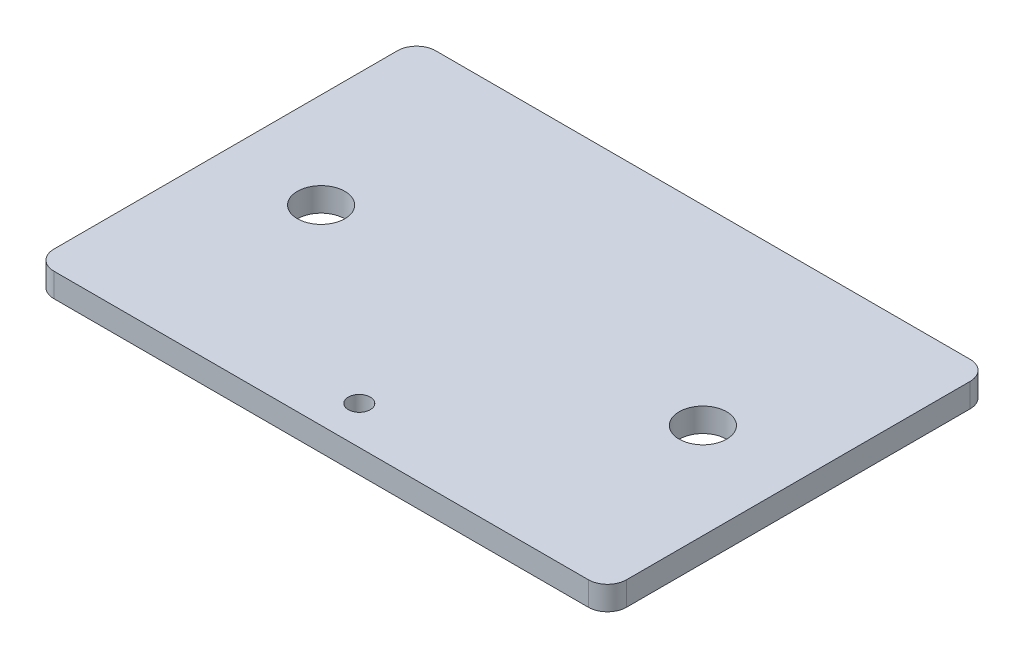
ISO-10303-21;
HEADER;
FILE_DESCRIPTION(('STEP AP214'),'2;1');
FILE_NAME('part.step','',(''),(''),'','','');
FILE_SCHEMA(('AUTOMOTIVE_DESIGN { 1 0 10303 214 1 1 1 1 }'));
ENDSEC;
DATA;
#1=APPLICATION_CONTEXT('core data for automotive mechanical design processes');
#2=APPLICATION_PROTOCOL_DEFINITION('international standard','automotive_design',2000,#1);
#3=PRODUCT_CONTEXT('',#1,'mechanical');
#4=PRODUCT('Part','Part','',(#3));
#5=PRODUCT_RELATED_PRODUCT_CATEGORY('part','',(#4));
#6=PRODUCT_DEFINITION_FORMATION('','',#4);
#7=PRODUCT_DEFINITION_CONTEXT('part definition',#1,'design');
#8=PRODUCT_DEFINITION('design','',#6,#7);
#9=PRODUCT_DEFINITION_SHAPE('','',#8);
#10=(LENGTH_UNIT() NAMED_UNIT(*) SI_UNIT(.MILLI.,.METRE.));
#11=(NAMED_UNIT(*) PLANE_ANGLE_UNIT() SI_UNIT($,.RADIAN.));
#12=(NAMED_UNIT(*) SI_UNIT($,.STERADIAN.) SOLID_ANGLE_UNIT());
#13=UNCERTAINTY_MEASURE_WITH_UNIT(LENGTH_MEASURE(1.E-05),#10,'distance_accuracy_value','');
#14=(GEOMETRIC_REPRESENTATION_CONTEXT(3) GLOBAL_UNCERTAINTY_ASSIGNED_CONTEXT((#13)) GLOBAL_UNIT_ASSIGNED_CONTEXT((#10,
#11,#12)) REPRESENTATION_CONTEXT('',''));
#15=CARTESIAN_POINT('',(0.,0.,0.));
#16=DIRECTION('',(0.,0.,1.));
#17=DIRECTION('',(1.,0.,0.));
#18=AXIS2_PLACEMENT_3D('',#15,#16,#17);
#19=CARTESIAN_POINT('',(0.,1.5875,0.));
#20=DIRECTION('',(0.,-1.,0.));
#21=DIRECTION('',(0.,0.,-1.));
#22=AXIS2_PLACEMENT_3D('',#19,#20,#21);
#23=PLANE('',#22);
#24=DIRECTION('',(-1.,0.,0.));
#25=VECTOR('',#24,1.);
#26=CARTESIAN_POINT('',(38.1,1.5875,-25.4));
#27=LINE('',#26,#25);
#28=CARTESIAN_POINT('',(35.56,1.5875,-25.4));
#29=VERTEX_POINT('',#28);
#30=CARTESIAN_POINT('',(-35.56,1.5875,-25.4));
#31=VERTEX_POINT('',#30);
#32=EDGE_CURVE('E136',#29,#31,#27,.T.);
#33=ORIENTED_EDGE('',*,*,#32,.T.);
#34=CARTESIAN_POINT('',(-35.56,1.5875,-22.86));
#35=DIRECTION('',(0.,-1.,0.));
#36=DIRECTION('',(0.,0.,-1.));
#37=AXIS2_PLACEMENT_3D('',#34,#35,#36);
#38=CIRCLE('',#37,2.54);
#39=CARTESIAN_POINT('',(-38.1,1.5875,-22.86));
#40=VERTEX_POINT('',#39);
#41=EDGE_CURVE('E155',#31,#40,#38,.F.);
#42=ORIENTED_EDGE('',*,*,#41,.T.);
#43=DIRECTION('',(0.,0.,1.));
#44=VECTOR('',#43,1.);
#45=CARTESIAN_POINT('',(-38.1,1.5875,-25.4));
#46=LINE('',#45,#44);
#47=CARTESIAN_POINT('',(-38.1,1.5875,22.86));
#48=VERTEX_POINT('',#47);
#49=EDGE_CURVE('E119',#40,#48,#46,.T.);
#50=ORIENTED_EDGE('',*,*,#49,.T.);
#51=CARTESIAN_POINT('',(-35.56,1.5875,22.86));
#52=DIRECTION('',(0.,-1.,0.));
#53=DIRECTION('',(0.,0.,-1.));
#54=AXIS2_PLACEMENT_3D('',#51,#52,#53);
#55=CIRCLE('',#54,2.54);
#56=CARTESIAN_POINT('',(-35.56,1.5875,25.4));
#57=VERTEX_POINT('',#56);
#58=EDGE_CURVE('E150',#48,#57,#55,.F.);
#59=ORIENTED_EDGE('',*,*,#58,.T.);
#60=DIRECTION('',(1.,0.,0.));
#61=VECTOR('',#60,1.);
#62=CARTESIAN_POINT('',(38.1,1.5875,25.4));
#63=LINE('',#62,#61);
#64=CARTESIAN_POINT('',(35.56,1.5875,25.4));
#65=VERTEX_POINT('',#64);
#66=EDGE_CURVE('E166',#57,#65,#63,.T.);
#67=ORIENTED_EDGE('',*,*,#66,.T.);
#68=CARTESIAN_POINT('',(35.56,1.5875,22.86));
#69=DIRECTION('',(0.,-1.,0.));
#70=DIRECTION('',(0.,0.,-1.));
#71=AXIS2_PLACEMENT_3D('',#68,#69,#70);
#72=CIRCLE('',#71,2.54);
#73=CARTESIAN_POINT('',(38.1,1.5875,22.86));
#74=VERTEX_POINT('',#73);
#75=EDGE_CURVE('E55',#65,#74,#72,.F.);
#76=ORIENTED_EDGE('',*,*,#75,.T.);
#77=DIRECTION('',(0.,0.,-1.));
#78=VECTOR('',#77,1.);
#79=CARTESIAN_POINT('',(38.1,1.5875,-25.4));
#80=LINE('',#79,#78);
#81=CARTESIAN_POINT('',(38.1,1.5875,-22.86));
#82=VERTEX_POINT('',#81);
#83=EDGE_CURVE('E174',#74,#82,#80,.T.);
#84=ORIENTED_EDGE('',*,*,#83,.T.);
#85=CARTESIAN_POINT('',(35.56,1.5875,-22.86));
#86=DIRECTION('',(0.,-1.,0.));
#87=DIRECTION('',(0.,0.,-1.));
#88=AXIS2_PLACEMENT_3D('',#85,#86,#87);
#89=CIRCLE('',#88,2.54);
#90=EDGE_CURVE('E153',#82,#29,#89,.F.);
#91=ORIENTED_EDGE('',*,*,#90,.T.);
#92=EDGE_LOOP('',(#33,#42,#50,#59,#67,#76,#84,#91));
#93=FACE_BOUND('',#92,.T.);
#94=CARTESIAN_POINT('',(0.,1.5875,20.32));
#95=DIRECTION('',(0.,1.,0.));
#96=DIRECTION('',(0.,0.,1.));
#97=AXIS2_PLACEMENT_3D('',#94,#95,#96);
#98=CIRCLE('',#97,1.4605);
#99=CARTESIAN_POINT('',(0.,1.5875,21.7805));
#100=VERTEX_POINT('',#99);
#101=EDGE_CURVE('E127',#100,#100,#98,.T.);
#102=ORIENTED_EDGE('',*,*,#101,.F.);
#103=EDGE_LOOP('',(#102));
#104=FACE_BOUND('',#103,.T.);
#105=CARTESIAN_POINT('',(-25.4,1.5875,0.));
#106=DIRECTION('',(0.,1.,0.));
#107=DIRECTION('',(0.,0.,1.));
#108=AXIS2_PLACEMENT_3D('',#105,#106,#107);
#109=CIRCLE('',#108,3.1623);
#110=CARTESIAN_POINT('',(-25.4,1.5875,3.1623));
#111=VERTEX_POINT('',#110);
#112=EDGE_CURVE('E181',#111,#111,#109,.T.);
#113=ORIENTED_EDGE('',*,*,#112,.F.);
#114=EDGE_LOOP('',(#113));
#115=FACE_BOUND('',#114,.T.);
#116=CARTESIAN_POINT('',(25.4,1.5875,0.));
#117=DIRECTION('',(0.,1.,0.));
#118=DIRECTION('',(0.,0.,1.));
#119=AXIS2_PLACEMENT_3D('',#116,#117,#118);
#120=CIRCLE('',#119,3.1623);
#121=CARTESIAN_POINT('',(25.4,1.5875,3.1623));
#122=VERTEX_POINT('',#121);
#123=EDGE_CURVE('E186',#122,#122,#120,.T.);
#124=ORIENTED_EDGE('',*,*,#123,.F.);
#125=EDGE_LOOP('',(#124));
#126=FACE_BOUND('',#125,.T.);
#127=ADVANCED_FACE('F33',(#93,#104,#115,#126),#23,.F.);
#128=CARTESIAN_POINT('',(0.,-1.5875,0.));
#129=DIRECTION('',(0.,-1.,0.));
#130=DIRECTION('',(0.,0.,-1.));
#131=AXIS2_PLACEMENT_3D('',#128,#129,#130);
#132=PLANE('',#131);
#133=CARTESIAN_POINT('',(-25.4,-1.5875,0.));
#134=DIRECTION('',(0.,1.,0.));
#135=DIRECTION('',(0.,0.,1.));
#136=AXIS2_PLACEMENT_3D('',#133,#134,#135);
#137=CIRCLE('',#136,3.1623);
#138=CARTESIAN_POINT('',(-25.4,-1.5875,3.1623));
#139=VERTEX_POINT('',#138);
#140=EDGE_CURVE('E183',#139,#139,#137,.T.);
#141=ORIENTED_EDGE('',*,*,#140,.T.);
#142=EDGE_LOOP('',(#141));
#143=FACE_BOUND('',#142,.T.);
#144=DIRECTION('',(0.,0.,1.));
#145=VECTOR('',#144,1.);
#146=CARTESIAN_POINT('',(-38.1,-1.5875,-25.4));
#147=LINE('',#146,#145);
#148=CARTESIAN_POINT('',(-38.1,-1.5875,-22.86));
#149=VERTEX_POINT('',#148);
#150=CARTESIAN_POINT('',(-38.1,-1.5875,22.86));
#151=VERTEX_POINT('',#150);
#152=EDGE_CURVE('E116',#149,#151,#147,.T.);
#153=ORIENTED_EDGE('',*,*,#152,.F.);
#154=CARTESIAN_POINT('',(-35.56,-1.5875,-22.86));
#155=DIRECTION('',(0.,-1.,0.));
#156=DIRECTION('',(0.,0.,-1.));
#157=AXIS2_PLACEMENT_3D('',#154,#155,#156);
#158=CIRCLE('',#157,2.54);
#159=CARTESIAN_POINT('',(-35.56,-1.5875,-25.4));
#160=VERTEX_POINT('',#159);
#161=EDGE_CURVE('E99',#149,#160,#158,.T.);
#162=ORIENTED_EDGE('',*,*,#161,.T.);
#163=DIRECTION('',(-1.,0.,0.));
#164=VECTOR('',#163,1.);
#165=CARTESIAN_POINT('',(38.1,-1.5875,-25.4));
#166=LINE('',#165,#164);
#167=CARTESIAN_POINT('',(35.56,-1.5875,-25.4));
#168=VERTEX_POINT('',#167);
#169=EDGE_CURVE('E140',#168,#160,#166,.T.);
#170=ORIENTED_EDGE('',*,*,#169,.F.);
#171=CARTESIAN_POINT('',(35.56,-1.5875,-22.86));
#172=DIRECTION('',(0.,-1.,0.));
#173=DIRECTION('',(0.,0.,-1.));
#174=AXIS2_PLACEMENT_3D('',#171,#172,#173);
#175=CIRCLE('',#174,2.54);
#176=CARTESIAN_POINT('',(38.1,-1.5875,-22.86));
#177=VERTEX_POINT('',#176);
#178=EDGE_CURVE('E110',#168,#177,#175,.T.);
#179=ORIENTED_EDGE('',*,*,#178,.T.);
#180=DIRECTION('',(0.,0.,-1.));
#181=VECTOR('',#180,1.);
#182=CARTESIAN_POINT('',(38.1,-1.5875,-25.4));
#183=LINE('',#182,#181);
#184=CARTESIAN_POINT('',(38.1,-1.5875,22.86));
#185=VERTEX_POINT('',#184);
#186=EDGE_CURVE('E130',#185,#177,#183,.T.);
#187=ORIENTED_EDGE('',*,*,#186,.F.);
#188=CARTESIAN_POINT('',(35.56,-1.5875,22.86));
#189=DIRECTION('',(0.,-1.,0.));
#190=DIRECTION('',(0.,0.,-1.));
#191=AXIS2_PLACEMENT_3D('',#188,#189,#190);
#192=CIRCLE('',#191,2.54);
#193=CARTESIAN_POINT('',(35.56,-1.5875,25.4));
#194=VERTEX_POINT('',#193);
#195=EDGE_CURVE('E144',#185,#194,#192,.T.);
#196=ORIENTED_EDGE('',*,*,#195,.T.);
#197=DIRECTION('',(1.,0.,0.));
#198=VECTOR('',#197,1.);
#199=CARTESIAN_POINT('',(38.1,-1.5875,25.4));
#200=LINE('',#199,#198);
#201=CARTESIAN_POINT('',(-35.56,-1.5875,25.4));
#202=VERTEX_POINT('',#201);
#203=EDGE_CURVE('E126',#202,#194,#200,.T.);
#204=ORIENTED_EDGE('',*,*,#203,.F.);
#205=CARTESIAN_POINT('',(-35.56,-1.5875,22.86));
#206=DIRECTION('',(0.,-1.,0.));
#207=DIRECTION('',(0.,0.,-1.));
#208=AXIS2_PLACEMENT_3D('',#205,#206,#207);
#209=CIRCLE('',#208,2.54);
#210=EDGE_CURVE('E120',#202,#151,#209,.T.);
#211=ORIENTED_EDGE('',*,*,#210,.T.);
#212=EDGE_LOOP('',(#153,#162,#170,#179,#187,#196,#204,#211));
#213=FACE_BOUND('',#212,.T.);
#214=CARTESIAN_POINT('',(0.,-1.5875,20.32));
#215=DIRECTION('',(0.,1.,0.));
#216=DIRECTION('',(0.,0.,1.));
#217=AXIS2_PLACEMENT_3D('',#214,#215,#216);
#218=CIRCLE('',#217,1.4605);
#219=CARTESIAN_POINT('',(0.,-1.5875,21.7805));
#220=VERTEX_POINT('',#219);
#221=EDGE_CURVE('E133',#220,#220,#218,.T.);
#222=ORIENTED_EDGE('',*,*,#221,.T.);
#223=EDGE_LOOP('',(#222));
#224=FACE_BOUND('',#223,.T.);
#225=CARTESIAN_POINT('',(25.4,-1.5875,0.));
#226=DIRECTION('',(0.,1.,0.));
#227=DIRECTION('',(0.,0.,1.));
#228=AXIS2_PLACEMENT_3D('',#225,#226,#227);
#229=CIRCLE('',#228,3.1623);
#230=CARTESIAN_POINT('',(25.4,-1.5875,3.1623));
#231=VERTEX_POINT('',#230);
#232=EDGE_CURVE('E189',#231,#231,#229,.T.);
#233=ORIENTED_EDGE('',*,*,#232,.T.);
#234=EDGE_LOOP('',(#233));
#235=FACE_BOUND('',#234,.T.);
#236=ADVANCED_FACE('F123',(#143,#213,#224,#235),#132,.T.);
#237=CARTESIAN_POINT('',(-38.1,1.5875,-25.4));
#238=DIRECTION('',(1.,0.,0.));
#239=DIRECTION('',(0.,0.,-1.));
#240=AXIS2_PLACEMENT_3D('',#237,#238,#239);
#241=PLANE('',#240);
#242=ORIENTED_EDGE('',*,*,#49,.F.);
#243=DIRECTION('',(0.,-1.,0.));
#244=VECTOR('',#243,1.);
#245=CARTESIAN_POINT('',(-38.1,1.5875,-22.86));
#246=LINE('',#245,#244);
#247=EDGE_CURVE('E103',#40,#149,#246,.T.);
#248=ORIENTED_EDGE('',*,*,#247,.T.);
#249=ORIENTED_EDGE('',*,*,#152,.T.);
#250=DIRECTION('',(0.,-1.,0.));
#251=VECTOR('',#250,1.);
#252=CARTESIAN_POINT('',(-38.1,1.5875,22.86));
#253=LINE('',#252,#251);
#254=EDGE_CURVE('E121',#151,#48,#253,.F.);
#255=ORIENTED_EDGE('',*,*,#254,.T.);
#256=EDGE_LOOP('',(#242,#248,#249,#255));
#257=FACE_BOUND('',#256,.T.);
#258=ADVANCED_FACE('F115',(#257),#241,.F.);
#259=CARTESIAN_POINT('',(38.1,1.5875,25.4));
#260=DIRECTION('',(0.,0.,-1.));
#261=DIRECTION('',(-1.,0.,0.));
#262=AXIS2_PLACEMENT_3D('',#259,#260,#261);
#263=PLANE('',#262);
#264=ORIENTED_EDGE('',*,*,#203,.T.);
#265=DIRECTION('',(0.,-1.,0.));
#266=VECTOR('',#265,1.);
#267=CARTESIAN_POINT('',(35.56,1.5875,25.4));
#268=LINE('',#267,#266);
#269=EDGE_CURVE('E11',#194,#65,#268,.F.);
#270=ORIENTED_EDGE('',*,*,#269,.T.);
#271=ORIENTED_EDGE('',*,*,#66,.F.);
#272=DIRECTION('',(0.,-1.,0.));
#273=VECTOR('',#272,1.);
#274=CARTESIAN_POINT('',(-35.56,1.5875,25.4));
#275=LINE('',#274,#273);
#276=EDGE_CURVE('E41',#57,#202,#275,.T.);
#277=ORIENTED_EDGE('',*,*,#276,.T.);
#278=EDGE_LOOP('',(#264,#270,#271,#277));
#279=FACE_BOUND('',#278,.T.);
#280=ADVANCED_FACE('F164',(#279),#263,.F.);
#281=CARTESIAN_POINT('',(38.1,1.5875,-25.4));
#282=DIRECTION('',(-1.,0.,0.));
#283=DIRECTION('',(0.,0.,1.));
#284=AXIS2_PLACEMENT_3D('',#281,#282,#283);
#285=PLANE('',#284);
#286=ORIENTED_EDGE('',*,*,#186,.T.);
#287=DIRECTION('',(0.,-1.,0.));
#288=VECTOR('',#287,1.);
#289=CARTESIAN_POINT('',(38.1,1.5875,-22.86));
#290=LINE('',#289,#288);
#291=EDGE_CURVE('E48',#177,#82,#290,.F.);
#292=ORIENTED_EDGE('',*,*,#291,.T.);
#293=ORIENTED_EDGE('',*,*,#83,.F.);
#294=DIRECTION('',(0.,-1.,0.));
#295=VECTOR('',#294,1.);
#296=CARTESIAN_POINT('',(38.1,1.5875,22.86));
#297=LINE('',#296,#295);
#298=EDGE_CURVE('E157',#74,#185,#297,.T.);
#299=ORIENTED_EDGE('',*,*,#298,.T.);
#300=EDGE_LOOP('',(#286,#292,#293,#299));
#301=FACE_BOUND('',#300,.T.);
#302=ADVANCED_FACE('F173',(#301),#285,.F.);
#303=CARTESIAN_POINT('',(38.1,1.5875,-25.4));
#304=DIRECTION('',(0.,0.,1.));
#305=DIRECTION('',(1.,0.,0.));
#306=AXIS2_PLACEMENT_3D('',#303,#304,#305);
#307=PLANE('',#306);
#308=ORIENTED_EDGE('',*,*,#169,.T.);
#309=DIRECTION('',(0.,-1.,0.));
#310=VECTOR('',#309,1.);
#311=CARTESIAN_POINT('',(-35.56,1.5875,-25.4));
#312=LINE('',#311,#310);
#313=EDGE_CURVE('E104',#160,#31,#312,.F.);
#314=ORIENTED_EDGE('',*,*,#313,.T.);
#315=ORIENTED_EDGE('',*,*,#32,.F.);
#316=DIRECTION('',(0.,-1.,0.));
#317=VECTOR('',#316,1.);
#318=CARTESIAN_POINT('',(35.56,1.5875,-25.4));
#319=LINE('',#318,#317);
#320=EDGE_CURVE('E109',#29,#168,#319,.T.);
#321=ORIENTED_EDGE('',*,*,#320,.T.);
#322=EDGE_LOOP('',(#308,#314,#315,#321));
#323=FACE_BOUND('',#322,.T.);
#324=ADVANCED_FACE('F210',(#323),#307,.F.);
#325=CARTESIAN_POINT('',(0.,1.5875,20.32));
#326=DIRECTION('',(0.,-1.,0.));
#327=DIRECTION('',(0.,0.,-1.));
#328=AXIS2_PLACEMENT_3D('',#325,#326,#327);
#329=CYLINDRICAL_SURFACE('',#328,1.4605);
#330=ORIENTED_EDGE('',*,*,#101,.T.);
#331=EDGE_LOOP('',(#330));
#332=FACE_BOUND('',#331,.T.);
#333=ORIENTED_EDGE('',*,*,#221,.F.);
#334=EDGE_LOOP('',(#333));
#335=FACE_BOUND('',#334,.T.);
#336=ADVANCED_FACE('F207',(#332,#335),#329,.F.);
#337=CARTESIAN_POINT('',(-25.4,1.5875,0.));
#338=DIRECTION('',(0.,-1.,0.));
#339=DIRECTION('',(0.,0.,-1.));
#340=AXIS2_PLACEMENT_3D('',#337,#338,#339);
#341=CYLINDRICAL_SURFACE('',#340,3.1623);
#342=ORIENTED_EDGE('',*,*,#112,.T.);
#343=EDGE_LOOP('',(#342));
#344=FACE_BOUND('',#343,.T.);
#345=ORIENTED_EDGE('',*,*,#140,.F.);
#346=EDGE_LOOP('',(#345));
#347=FACE_BOUND('',#346,.T.);
#348=ADVANCED_FACE('F294',(#344,#347),#341,.F.);
#349=CARTESIAN_POINT('',(25.4,1.5875,0.));
#350=DIRECTION('',(0.,-1.,0.));
#351=DIRECTION('',(0.,0.,-1.));
#352=AXIS2_PLACEMENT_3D('',#349,#350,#351);
#353=CYLINDRICAL_SURFACE('',#352,3.1623);
#354=ORIENTED_EDGE('',*,*,#123,.T.);
#355=EDGE_LOOP('',(#354));
#356=FACE_BOUND('',#355,.T.);
#357=ORIENTED_EDGE('',*,*,#232,.F.);
#358=EDGE_LOOP('',(#357));
#359=FACE_BOUND('',#358,.T.);
#360=ADVANCED_FACE('F195',(#356,#359),#353,.F.);
#361=CARTESIAN_POINT('',(-35.56,1.5875,-22.86));
#362=DIRECTION('',(0.,-1.,0.));
#363=DIRECTION('',(0.,0.,-1.));
#364=AXIS2_PLACEMENT_3D('',#361,#362,#363);
#365=CYLINDRICAL_SURFACE('',#364,2.54);
#366=ORIENTED_EDGE('',*,*,#41,.F.);
#367=ORIENTED_EDGE('',*,*,#313,.F.);
#368=ORIENTED_EDGE('',*,*,#161,.F.);
#369=ORIENTED_EDGE('',*,*,#247,.F.);
#370=EDGE_LOOP('',(#366,#367,#368,#369));
#371=FACE_BOUND('',#370,.T.);
#372=ADVANCED_FACE('F102',(#371),#365,.T.);
#373=CARTESIAN_POINT('',(35.56,1.5875,-22.86));
#374=DIRECTION('',(0.,-1.,0.));
#375=DIRECTION('',(0.,0.,-1.));
#376=AXIS2_PLACEMENT_3D('',#373,#374,#375);
#377=CYLINDRICAL_SURFACE('',#376,2.54);
#378=ORIENTED_EDGE('',*,*,#90,.F.);
#379=ORIENTED_EDGE('',*,*,#291,.F.);
#380=ORIENTED_EDGE('',*,*,#178,.F.);
#381=ORIENTED_EDGE('',*,*,#320,.F.);
#382=EDGE_LOOP('',(#378,#379,#380,#381));
#383=FACE_BOUND('',#382,.T.);
#384=ADVANCED_FACE('F222',(#383),#377,.T.);
#385=CARTESIAN_POINT('',(35.56,1.5875,22.86));
#386=DIRECTION('',(0.,-1.,0.));
#387=DIRECTION('',(0.,0.,-1.));
#388=AXIS2_PLACEMENT_3D('',#385,#386,#387);
#389=CYLINDRICAL_SURFACE('',#388,2.54);
#390=ORIENTED_EDGE('',*,*,#75,.F.);
#391=ORIENTED_EDGE('',*,*,#269,.F.);
#392=ORIENTED_EDGE('',*,*,#195,.F.);
#393=ORIENTED_EDGE('',*,*,#298,.F.);
#394=EDGE_LOOP('',(#390,#391,#392,#393));
#395=FACE_BOUND('',#394,.T.);
#396=ADVANCED_FACE('F172',(#395),#389,.T.);
#397=CARTESIAN_POINT('',(-35.56,1.5875,22.86));
#398=DIRECTION('',(0.,-1.,0.));
#399=DIRECTION('',(0.,0.,-1.));
#400=AXIS2_PLACEMENT_3D('',#397,#398,#399);
#401=CYLINDRICAL_SURFACE('',#400,2.54);
#402=ORIENTED_EDGE('',*,*,#58,.F.);
#403=ORIENTED_EDGE('',*,*,#254,.F.);
#404=ORIENTED_EDGE('',*,*,#210,.F.);
#405=ORIENTED_EDGE('',*,*,#276,.F.);
#406=EDGE_LOOP('',(#402,#403,#404,#405));
#407=FACE_BOUND('',#406,.T.);
#408=ADVANCED_FACE('F35',(#407),#401,.T.);
#409=CLOSED_SHELL('',(#127,#236,#258,#280,#302,#324,#336,#348,#360,#372,#384,#396,#408));
#410=MANIFOLD_SOLID_BREP('B2',#409);
#411=ADVANCED_BREP_SHAPE_REPRESENTATION('',(#18,#410),#14);
#412=SHAPE_DEFINITION_REPRESENTATION(#9,#411);
ENDSEC;
END-ISO-10303-21;
